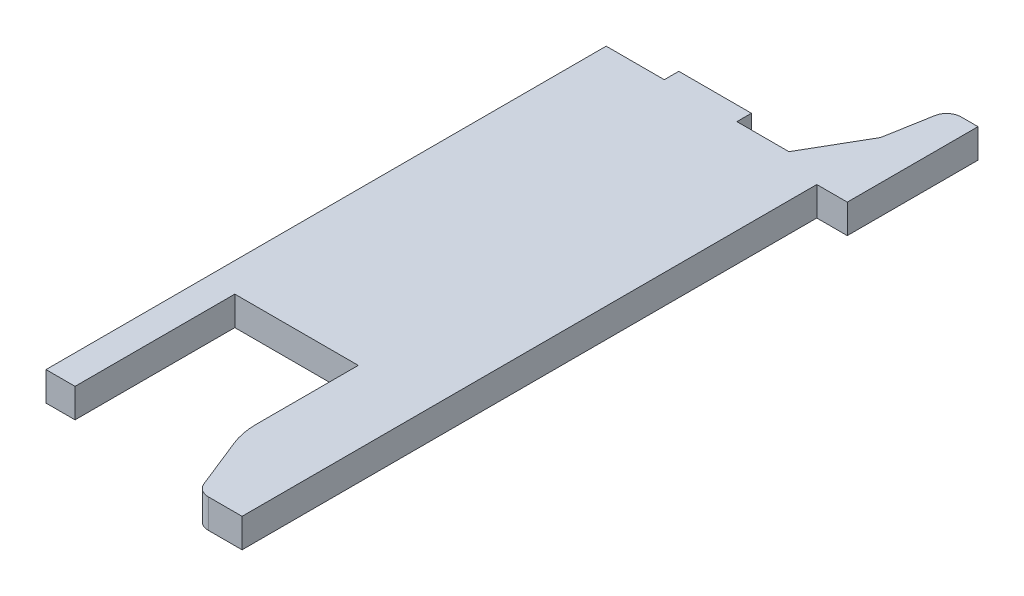
ISO-10303-21;
HEADER;
FILE_DESCRIPTION(('STEP AP214'),'2;1');
FILE_NAME('part.step','',(''),(''),'','','');
FILE_SCHEMA(('AUTOMOTIVE_DESIGN { 1 0 10303 214 1 1 1 1 }'));
ENDSEC;
DATA;
#1=APPLICATION_CONTEXT('core data for automotive mechanical design processes');
#2=APPLICATION_PROTOCOL_DEFINITION('international standard','automotive_design',2000,#1);
#3=PRODUCT_CONTEXT('',#1,'mechanical');
#4=PRODUCT('Part','Part','',(#3));
#5=PRODUCT_RELATED_PRODUCT_CATEGORY('part','',(#4));
#6=PRODUCT_DEFINITION_FORMATION('','',#4);
#7=PRODUCT_DEFINITION_CONTEXT('part definition',#1,'design');
#8=PRODUCT_DEFINITION('design','',#6,#7);
#9=PRODUCT_DEFINITION_SHAPE('','',#8);
#10=(LENGTH_UNIT() NAMED_UNIT(*) SI_UNIT(.MILLI.,.METRE.));
#11=(NAMED_UNIT(*) PLANE_ANGLE_UNIT() SI_UNIT($,.RADIAN.));
#12=(NAMED_UNIT(*) SI_UNIT($,.STERADIAN.) SOLID_ANGLE_UNIT());
#13=UNCERTAINTY_MEASURE_WITH_UNIT(LENGTH_MEASURE(1.E-05),#10,'distance_accuracy_value','');
#14=(GEOMETRIC_REPRESENTATION_CONTEXT(3) GLOBAL_UNCERTAINTY_ASSIGNED_CONTEXT((#13)) GLOBAL_UNIT_ASSIGNED_CONTEXT((#10,
#11,#12)) REPRESENTATION_CONTEXT('',''));
#15=CARTESIAN_POINT('',(0.,0.,0.));
#16=DIRECTION('',(0.,0.,1.));
#17=DIRECTION('',(1.,0.,0.));
#18=AXIS2_PLACEMENT_3D('',#15,#16,#17);
#19=CARTESIAN_POINT('',(0.868909963118,-0.1,-1.1));
#20=DIRECTION('',(0.,1.,0.));
#21=DIRECTION('',(0.,0.,1.));
#22=AXIS2_PLACEMENT_3D('',#19,#20,#21);
#23=CYLINDRICAL_SURFACE('',#22,0.1);
#24=CARTESIAN_POINT('',(0.868909963118,-0.1,-1.1));
#25=DIRECTION('',(0.,-1.,0.));
#26=DIRECTION('',(0.,0.,-1.));
#27=AXIS2_PLACEMENT_3D('',#24,#25,#26);
#28=CIRCLE('',#27,0.1);
#29=CARTESIAN_POINT('',(0.770429187817,-0.1,-1.117364817767));
#30=VERTEX_POINT('',#29);
#31=CARTESIAN_POINT('',(0.868909963118,-0.1,-1.2));
#32=VERTEX_POINT('',#31);
#33=EDGE_CURVE('E20',#30,#32,#28,.T.);
#34=ORIENTED_EDGE('',*,*,#33,.F.);
#35=DIRECTION('',(0.,-1.,0.));
#36=VECTOR('',#35,1.);
#37=CARTESIAN_POINT('',(0.770429187817,-0.1,-1.117364817767));
#38=LINE('',#37,#36);
#39=CARTESIAN_POINT('',(0.770429187817,0.1,-1.117364817767));
#40=VERTEX_POINT('',#39);
#41=EDGE_CURVE('E293',#40,#30,#38,.T.);
#42=ORIENTED_EDGE('',*,*,#41,.F.);
#43=CARTESIAN_POINT('',(0.868909963118,0.1,-1.1));
#44=DIRECTION('',(0.,1.,0.));
#45=DIRECTION('',(0.,0.,-1.));
#46=AXIS2_PLACEMENT_3D('',#43,#44,#45);
#47=CIRCLE('',#46,0.1);
#48=CARTESIAN_POINT('',(0.868909963118,0.1,-1.2));
#49=VERTEX_POINT('',#48);
#50=EDGE_CURVE('E11',#49,#40,#47,.T.);
#51=ORIENTED_EDGE('',*,*,#50,.F.);
#52=DIRECTION('',(0.,1.,0.));
#53=VECTOR('',#52,1.);
#54=CARTESIAN_POINT('',(0.868909963118,-0.1,-1.2));
#55=LINE('',#54,#53);
#56=EDGE_CURVE('E288',#32,#49,#55,.T.);
#57=ORIENTED_EDGE('',*,*,#56,.F.);
#58=EDGE_LOOP('',(#34,#42,#51,#57));
#59=FACE_BOUND('',#58,.T.);
#60=ADVANCED_FACE('F17',(#59),#23,.T.);
#61=CARTESIAN_POINT('',(0.775,0.1,3.060583310795));
#62=DIRECTION('',(0.,-1.,0.));
#63=DIRECTION('',(0.,0.,-1.));
#64=AXIS2_PLACEMENT_3D('',#61,#62,#63);
#65=PLANE('',#64);
#66=DIRECTION('',(-1.,0.,0.));
#67=VECTOR('',#66,1.);
#68=CARTESIAN_POINT('',(0.985,0.1,-1.2));
#69=LINE('',#68,#67);
#70=CARTESIAN_POINT('',(0.985,0.1,-1.2));
#71=VERTEX_POINT('',#70);
#72=EDGE_CURVE('E349',#71,#49,#69,.T.);
#73=ORIENTED_EDGE('',*,*,#72,.T.);
#74=ORIENTED_EDGE('',*,*,#50,.T.);
#75=DIRECTION('',(-0.173648177667033,0.,0.98480775301219));
#76=VECTOR('',#75,1.);
#77=CARTESIAN_POINT('',(0.785,0.1,-1.2));
#78=LINE('',#77,#76);
#79=CARTESIAN_POINT('',(0.714469207717,0.1,-0.8));
#80=VERTEX_POINT('',#79);
#81=EDGE_CURVE('E290',#40,#80,#78,.T.);
#82=ORIENTED_EDGE('',*,*,#81,.T.);
#83=DIRECTION('',(-0.50000000000019,0.,0.866025403784329));
#84=VECTOR('',#83,1.);
#85=CARTESIAN_POINT('',(0.714469207717,0.1,-0.8));
#86=LINE('',#85,#84);
#87=CARTESIAN_POINT('',(0.483529100041,0.1,-0.4));
#88=VERTEX_POINT('',#87);
#89=EDGE_CURVE('E332',#80,#88,#86,.T.);
#90=ORIENTED_EDGE('',*,*,#89,.T.);
#91=DIRECTION('',(-1.,0.,0.));
#92=VECTOR('',#91,1.);
#93=CARTESIAN_POINT('',(0.125,0.1,-0.4));
#94=LINE('',#93,#92);
#95=CARTESIAN_POINT('',(0.125,0.1,-0.4));
#96=VERTEX_POINT('',#95);
#97=EDGE_CURVE('E311',#88,#96,#94,.T.);
#98=ORIENTED_EDGE('',*,*,#97,.T.);
#99=DIRECTION('',(0.,0.,-1.));
#100=VECTOR('',#99,1.);
#101=CARTESIAN_POINT('',(0.125,0.1,-0.4));
#102=LINE('',#101,#100);
#103=CARTESIAN_POINT('',(0.125,0.1,-0.5));
#104=VERTEX_POINT('',#103);
#105=EDGE_CURVE('E283',#96,#104,#102,.T.);
#106=ORIENTED_EDGE('',*,*,#105,.T.);
#107=DIRECTION('',(-1.,0.,0.));
#108=VECTOR('',#107,1.);
#109=CARTESIAN_POINT('',(-0.375,0.1,-0.5));
#110=LINE('',#109,#108);
#111=CARTESIAN_POINT('',(-0.375,0.1,-0.5));
#112=VERTEX_POINT('',#111);
#113=EDGE_CURVE('E277',#104,#112,#110,.T.);
#114=ORIENTED_EDGE('',*,*,#113,.T.);
#115=DIRECTION('',(0.,0.,1.));
#116=VECTOR('',#115,1.);
#117=CARTESIAN_POINT('',(-0.375,0.1,-0.4));
#118=LINE('',#117,#116);
#119=CARTESIAN_POINT('',(-0.375,0.1,-0.4));
#120=VERTEX_POINT('',#119);
#121=EDGE_CURVE('E243',#112,#120,#118,.T.);
#122=ORIENTED_EDGE('',*,*,#121,.T.);
#123=DIRECTION('',(-1.,0.,0.));
#124=VECTOR('',#123,1.);
#125=CARTESIAN_POINT('',(-0.775,0.1,-0.4));
#126=LINE('',#125,#124);
#127=CARTESIAN_POINT('',(-0.775,0.1,-0.4));
#128=VERTEX_POINT('',#127);
#129=EDGE_CURVE('E226',#120,#128,#126,.T.);
#130=ORIENTED_EDGE('',*,*,#129,.T.);
#131=DIRECTION('',(0.,0.,1.));
#132=VECTOR('',#131,1.);
#133=CARTESIAN_POINT('',(-0.775,0.1,-0.4));
#134=LINE('',#133,#132);
#135=CARTESIAN_POINT('',(-0.775,0.1,3.456874512579));
#136=VERTEX_POINT('',#135);
#137=EDGE_CURVE('E230',#128,#136,#134,.T.);
#138=ORIENTED_EDGE('',*,*,#137,.T.);
#139=DIRECTION('',(1.,0.,0.));
#140=VECTOR('',#139,1.);
#141=CARTESIAN_POINT('',(-0.775,0.1,3.456874512579));
#142=LINE('',#141,#140);
#143=CARTESIAN_POINT('',(-0.575,0.1,3.456874512579));
#144=VERTEX_POINT('',#143);
#145=EDGE_CURVE('E48',#136,#144,#142,.T.);
#146=ORIENTED_EDGE('',*,*,#145,.T.);
#147=DIRECTION('',(0.,0.,-1.));
#148=VECTOR('',#147,1.);
#149=CARTESIAN_POINT('',(-0.575,0.1,2.356874512579));
#150=LINE('',#149,#148);
#151=CARTESIAN_POINT('',(-0.575,0.1,2.356874512579));
#152=VERTEX_POINT('',#151);
#153=EDGE_CURVE('E414',#144,#152,#150,.T.);
#154=ORIENTED_EDGE('',*,*,#153,.T.);
#155=DIRECTION('',(1.,0.,0.));
#156=VECTOR('',#155,1.);
#157=CARTESIAN_POINT('',(-0.575,0.1,2.356874512579));
#158=LINE('',#157,#156);
#159=CARTESIAN_POINT('',(0.275,0.1,2.356874512579));
#160=VERTEX_POINT('',#159);
#161=EDGE_CURVE('E407',#152,#160,#158,.T.);
#162=ORIENTED_EDGE('',*,*,#161,.T.);
#163=DIRECTION('',(0.,0.,1.));
#164=VECTOR('',#163,1.);
#165=CARTESIAN_POINT('',(0.275,0.1,2.356874512579));
#166=LINE('',#165,#164);
#167=CARTESIAN_POINT('',(0.275,0.1,3.060583310795));
#168=VERTEX_POINT('',#167);
#169=EDGE_CURVE('E397',#160,#168,#166,.T.);
#170=ORIENTED_EDGE('',*,*,#169,.T.);
#171=CARTESIAN_POINT('',(0.775,0.1,3.060583310795));
#172=DIRECTION('',(0.,1.,0.));
#173=DIRECTION('',(0.,0.,-1.));
#174=AXIS2_PLACEMENT_3D('',#171,#172,#173);
#175=CIRCLE('',#174,0.5);
#176=CARTESIAN_POINT('',(0.310761654557,0.1,3.246278648972));
#177=VERTEX_POINT('',#176);
#178=EDGE_CURVE('E252',#168,#177,#175,.T.);
#179=ORIENTED_EDGE('',*,*,#178,.T.);
#180=DIRECTION('',(0.371390676354104,0.,0.928476690885259));
#181=VECTOR('',#180,1.);
#182=CARTESIAN_POINT('',(0.449855627054,0.1,3.594013580214));
#183=LINE('',#182,#181);
#184=CARTESIAN_POINT('',(0.449855627054,0.1,3.594013580214));
#185=VERTEX_POINT('',#184);
#186=EDGE_CURVE('E325',#177,#185,#183,.T.);
#187=ORIENTED_EDGE('',*,*,#186,.T.);
#188=CARTESIAN_POINT('',(0.542703296143,0.1,3.556874512579));
#189=DIRECTION('',(0.,1.,0.));
#190=DIRECTION('',(0.,0.,1.));
#191=AXIS2_PLACEMENT_3D('',#188,#189,#190);
#192=CIRCLE('',#191,0.1);
#193=CARTESIAN_POINT('',(0.542703296143,0.1,3.656874512579));
#194=VERTEX_POINT('',#193);
#195=EDGE_CURVE('E304',#185,#194,#192,.T.);
#196=ORIENTED_EDGE('',*,*,#195,.T.);
#197=DIRECTION('',(1.,0.,0.));
#198=VECTOR('',#197,1.);
#199=CARTESIAN_POINT('',(0.775,0.1,3.656874512579));
#200=LINE('',#199,#198);
#201=CARTESIAN_POINT('',(0.775,0.1,3.656874512579));
#202=VERTEX_POINT('',#201);
#203=EDGE_CURVE('E259',#194,#202,#200,.T.);
#204=ORIENTED_EDGE('',*,*,#203,.T.);
#205=DIRECTION('',(0.,0.,-1.));
#206=VECTOR('',#205,1.);
#207=CARTESIAN_POINT('',(0.775,0.1,-0.3));
#208=LINE('',#207,#206);
#209=CARTESIAN_POINT('',(0.775,0.1,-0.3));
#210=VERTEX_POINT('',#209);
#211=EDGE_CURVE('E363',#202,#210,#208,.T.);
#212=ORIENTED_EDGE('',*,*,#211,.T.);
#213=DIRECTION('',(1.,0.,0.));
#214=VECTOR('',#213,1.);
#215=CARTESIAN_POINT('',(0.775,0.1,-0.3));
#216=LINE('',#215,#214);
#217=CARTESIAN_POINT('',(0.985,0.1,-0.3));
#218=VERTEX_POINT('',#217);
#219=EDGE_CURVE('E270',#210,#218,#216,.T.);
#220=ORIENTED_EDGE('',*,*,#219,.T.);
#221=DIRECTION('',(0.,0.,-1.));
#222=VECTOR('',#221,1.);
#223=CARTESIAN_POINT('',(0.985,0.1,-0.4));
#224=LINE('',#223,#222);
#225=EDGE_CURVE('E360',#218,#71,#224,.T.);
#226=ORIENTED_EDGE('',*,*,#225,.T.);
#227=EDGE_LOOP('',(#73,#74,#82,#90,#98,#106,#114,#122,#130,#138,#146,#154,#162,#170,#179,#187,
#196,#204,#212,#220,#226));
#228=FACE_BOUND('',#227,.T.);
#229=ADVANCED_FACE('F439',(#228),#65,.F.);
#230=CARTESIAN_POINT('',(0.775,-0.1,3.060583310795));
#231=DIRECTION('',(0.,-1.,0.));
#232=DIRECTION('',(0.,0.,-1.));
#233=AXIS2_PLACEMENT_3D('',#230,#231,#232);
#234=PLANE('',#233);
#235=DIRECTION('',(-0.173648177667033,0.,0.98480775301219));
#236=VECTOR('',#235,1.);
#237=CARTESIAN_POINT('',(0.785,-0.1,-1.2));
#238=LINE('',#237,#236);
#239=CARTESIAN_POINT('',(0.714469207717,-0.1,-0.8));
#240=VERTEX_POINT('',#239);
#241=EDGE_CURVE('E289',#30,#240,#238,.T.);
#242=ORIENTED_EDGE('',*,*,#241,.F.);
#243=ORIENTED_EDGE('',*,*,#33,.T.);
#244=DIRECTION('',(-1.,0.,0.));
#245=VECTOR('',#244,1.);
#246=CARTESIAN_POINT('',(0.985,-0.1,-1.2));
#247=LINE('',#246,#245);
#248=CARTESIAN_POINT('',(0.985,-0.1,-1.2));
#249=VERTEX_POINT('',#248);
#250=EDGE_CURVE('E284',#249,#32,#247,.T.);
#251=ORIENTED_EDGE('',*,*,#250,.F.);
#252=DIRECTION('',(0.,0.,-1.));
#253=VECTOR('',#252,1.);
#254=CARTESIAN_POINT('',(0.985,-0.1,-0.4));
#255=LINE('',#254,#253);
#256=CARTESIAN_POINT('',(0.985,-0.1,-0.3));
#257=VERTEX_POINT('',#256);
#258=EDGE_CURVE('E356',#257,#249,#255,.T.);
#259=ORIENTED_EDGE('',*,*,#258,.F.);
#260=DIRECTION('',(1.,0.,0.));
#261=VECTOR('',#260,1.);
#262=CARTESIAN_POINT('',(0.775,-0.1,-0.3));
#263=LINE('',#262,#261);
#264=CARTESIAN_POINT('',(0.775,-0.1,-0.3));
#265=VERTEX_POINT('',#264);
#266=EDGE_CURVE('E269',#265,#257,#263,.T.);
#267=ORIENTED_EDGE('',*,*,#266,.F.);
#268=DIRECTION('',(0.,0.,-1.));
#269=VECTOR('',#268,1.);
#270=CARTESIAN_POINT('',(0.775,-0.1,-0.3));
#271=LINE('',#270,#269);
#272=CARTESIAN_POINT('',(0.775,-0.1,3.656874512579));
#273=VERTEX_POINT('',#272);
#274=EDGE_CURVE('E380',#273,#265,#271,.T.);
#275=ORIENTED_EDGE('',*,*,#274,.F.);
#276=DIRECTION('',(1.,0.,0.));
#277=VECTOR('',#276,1.);
#278=CARTESIAN_POINT('',(0.775,-0.1,3.656874512579));
#279=LINE('',#278,#277);
#280=CARTESIAN_POINT('',(0.542703296143,-0.1,3.656874512579));
#281=VERTEX_POINT('',#280);
#282=EDGE_CURVE('E258',#281,#273,#279,.T.);
#283=ORIENTED_EDGE('',*,*,#282,.F.);
#284=CARTESIAN_POINT('',(0.542703296143,-0.1,3.556874512579));
#285=DIRECTION('',(0.,1.,0.));
#286=DIRECTION('',(0.,0.,1.));
#287=AXIS2_PLACEMENT_3D('',#284,#285,#286);
#288=CIRCLE('',#287,0.1);
#289=CARTESIAN_POINT('',(0.449855627054,-0.1,3.594013580214));
#290=VERTEX_POINT('',#289);
#291=EDGE_CURVE('E316',#290,#281,#288,.T.);
#292=ORIENTED_EDGE('',*,*,#291,.F.);
#293=DIRECTION('',(0.371390676354104,0.,0.928476690885259));
#294=VECTOR('',#293,1.);
#295=CARTESIAN_POINT('',(0.449855627054,-0.1,3.594013580214));
#296=LINE('',#295,#294);
#297=CARTESIAN_POINT('',(0.310761654557,-0.1,3.246278648972));
#298=VERTEX_POINT('',#297);
#299=EDGE_CURVE('E324',#298,#290,#296,.T.);
#300=ORIENTED_EDGE('',*,*,#299,.F.);
#301=CARTESIAN_POINT('',(0.775,-0.1,3.060583310795));
#302=DIRECTION('',(0.,1.,0.));
#303=DIRECTION('',(0.,0.,-1.));
#304=AXIS2_PLACEMENT_3D('',#301,#302,#303);
#305=CIRCLE('',#304,0.5);
#306=CARTESIAN_POINT('',(0.275,-0.1,3.060583310795));
#307=VERTEX_POINT('',#306);
#308=EDGE_CURVE('E251',#307,#298,#305,.T.);
#309=ORIENTED_EDGE('',*,*,#308,.F.);
#310=DIRECTION('',(0.,0.,1.));
#311=VECTOR('',#310,1.);
#312=CARTESIAN_POINT('',(0.275,-0.1,2.356874512579));
#313=LINE('',#312,#311);
#314=CARTESIAN_POINT('',(0.275,-0.1,2.356874512579));
#315=VERTEX_POINT('',#314);
#316=EDGE_CURVE('E404',#315,#307,#313,.T.);
#317=ORIENTED_EDGE('',*,*,#316,.F.);
#318=DIRECTION('',(1.,0.,0.));
#319=VECTOR('',#318,1.);
#320=CARTESIAN_POINT('',(-0.575,-0.1,2.356874512579));
#321=LINE('',#320,#319);
#322=CARTESIAN_POINT('',(-0.575,-0.1,2.356874512579));
#323=VERTEX_POINT('',#322);
#324=EDGE_CURVE('E238',#323,#315,#321,.T.);
#325=ORIENTED_EDGE('',*,*,#324,.F.);
#326=DIRECTION('',(0.,0.,-1.));
#327=VECTOR('',#326,1.);
#328=CARTESIAN_POINT('',(-0.575,-0.1,2.356874512579));
#329=LINE('',#328,#327);
#330=CARTESIAN_POINT('',(-0.575,-0.1,3.456874512579));
#331=VERTEX_POINT('',#330);
#332=EDGE_CURVE('E214',#331,#323,#329,.T.);
#333=ORIENTED_EDGE('',*,*,#332,.F.);
#334=DIRECTION('',(1.,0.,0.));
#335=VECTOR('',#334,1.);
#336=CARTESIAN_POINT('',(-0.775,-0.1,3.456874512579));
#337=LINE('',#336,#335);
#338=CARTESIAN_POINT('',(-0.775,-0.1,3.456874512579));
#339=VERTEX_POINT('',#338);
#340=EDGE_CURVE('E38',#339,#331,#337,.T.);
#341=ORIENTED_EDGE('',*,*,#340,.F.);
#342=DIRECTION('',(0.,0.,1.));
#343=VECTOR('',#342,1.);
#344=CARTESIAN_POINT('',(-0.775,-0.1,-0.4));
#345=LINE('',#344,#343);
#346=CARTESIAN_POINT('',(-0.775,-0.1,-0.4));
#347=VERTEX_POINT('',#346);
#348=EDGE_CURVE('E211',#347,#339,#345,.T.);
#349=ORIENTED_EDGE('',*,*,#348,.F.);
#350=DIRECTION('',(-1.,0.,0.));
#351=VECTOR('',#350,1.);
#352=CARTESIAN_POINT('',(-0.775,-0.1,-0.4));
#353=LINE('',#352,#351);
#354=CARTESIAN_POINT('',(-0.375,-0.1,-0.4));
#355=VERTEX_POINT('',#354);
#356=EDGE_CURVE('E247',#355,#347,#353,.T.);
#357=ORIENTED_EDGE('',*,*,#356,.F.);
#358=DIRECTION('',(0.,0.,1.));
#359=VECTOR('',#358,1.);
#360=CARTESIAN_POINT('',(-0.375,-0.1,-0.4));
#361=LINE('',#360,#359);
#362=CARTESIAN_POINT('',(-0.375,-0.1,-0.5));
#363=VERTEX_POINT('',#362);
#364=EDGE_CURVE('E274',#363,#355,#361,.T.);
#365=ORIENTED_EDGE('',*,*,#364,.F.);
#366=DIRECTION('',(-1.,0.,0.));
#367=VECTOR('',#366,1.);
#368=CARTESIAN_POINT('',(-0.375,-0.1,-0.5));
#369=LINE('',#368,#367);
#370=CARTESIAN_POINT('',(0.125,-0.1,-0.5));
#371=VERTEX_POINT('',#370);
#372=EDGE_CURVE('E301',#371,#363,#369,.T.);
#373=ORIENTED_EDGE('',*,*,#372,.F.);
#374=DIRECTION('',(0.,0.,-1.));
#375=VECTOR('',#374,1.);
#376=CARTESIAN_POINT('',(0.125,-0.1,-0.4));
#377=LINE('',#376,#375);
#378=CARTESIAN_POINT('',(0.125,-0.1,-0.4));
#379=VERTEX_POINT('',#378);
#380=EDGE_CURVE('E282',#379,#371,#377,.T.);
#381=ORIENTED_EDGE('',*,*,#380,.F.);
#382=DIRECTION('',(-1.,0.,0.));
#383=VECTOR('',#382,1.);
#384=CARTESIAN_POINT('',(0.125,-0.1,-0.4));
#385=LINE('',#384,#383);
#386=CARTESIAN_POINT('',(0.483529100041,-0.1,-0.4));
#387=VERTEX_POINT('',#386);
#388=EDGE_CURVE('E329',#387,#379,#385,.T.);
#389=ORIENTED_EDGE('',*,*,#388,.F.);
#390=DIRECTION('',(-0.50000000000019,0.,0.866025403784329));
#391=VECTOR('',#390,1.);
#392=CARTESIAN_POINT('',(0.714469207717,-0.1,-0.8));
#393=LINE('',#392,#391);
#394=EDGE_CURVE('E294',#240,#387,#393,.T.);
#395=ORIENTED_EDGE('',*,*,#394,.F.);
#396=EDGE_LOOP('',(#242,#243,#251,#259,#267,#275,#283,#292,#300,#309,#317,#325,#333,#341,#349,
#357,#365,#373,#381,#389,#395));
#397=FACE_BOUND('',#396,.T.);
#398=ADVANCED_FACE('F209',(#397),#234,.T.);
#399=CARTESIAN_POINT('',(-0.775,-0.1,3.456874512579));
#400=DIRECTION('',(0.,0.,1.));
#401=DIRECTION('',(1.,0.,0.));
#402=AXIS2_PLACEMENT_3D('',#399,#400,#401);
#403=PLANE('',#402);
#404=DIRECTION('',(0.,1.,0.));
#405=VECTOR('',#404,1.);
#406=CARTESIAN_POINT('',(-0.575,-0.1,3.456874512579));
#407=LINE('',#406,#405);
#408=EDGE_CURVE('E416',#331,#144,#407,.T.);
#409=ORIENTED_EDGE('',*,*,#408,.T.);
#410=ORIENTED_EDGE('',*,*,#145,.F.);
#411=DIRECTION('',(0.,1.,0.));
#412=VECTOR('',#411,1.);
#413=CARTESIAN_POINT('',(-0.775,-0.1,3.456874512579));
#414=LINE('',#413,#412);
#415=EDGE_CURVE('E222',#339,#136,#414,.T.);
#416=ORIENTED_EDGE('',*,*,#415,.F.);
#417=ORIENTED_EDGE('',*,*,#340,.T.);
#418=EDGE_LOOP('',(#409,#410,#416,#417));
#419=FACE_BOUND('',#418,.T.);
#420=ADVANCED_FACE('F228',(#419),#403,.T.);
#421=CARTESIAN_POINT('',(-0.575,-0.1,2.356874512579));
#422=DIRECTION('',(1.,0.,0.));
#423=DIRECTION('',(0.,0.,-1.));
#424=AXIS2_PLACEMENT_3D('',#421,#422,#423);
#425=PLANE('',#424);
#426=DIRECTION('',(0.,1.,0.));
#427=VECTOR('',#426,1.);
#428=CARTESIAN_POINT('',(-0.575,-0.1,2.356874512579));
#429=LINE('',#428,#427);
#430=EDGE_CURVE('E410',#323,#152,#429,.T.);
#431=ORIENTED_EDGE('',*,*,#430,.T.);
#432=ORIENTED_EDGE('',*,*,#153,.F.);
#433=ORIENTED_EDGE('',*,*,#408,.F.);
#434=ORIENTED_EDGE('',*,*,#332,.T.);
#435=EDGE_LOOP('',(#431,#432,#433,#434));
#436=FACE_BOUND('',#435,.T.);
#437=ADVANCED_FACE('F667',(#436),#425,.T.);
#438=CARTESIAN_POINT('',(-0.575,-0.1,2.356874512579));
#439=DIRECTION('',(0.,0.,1.));
#440=DIRECTION('',(1.,0.,0.));
#441=AXIS2_PLACEMENT_3D('',#438,#439,#440);
#442=PLANE('',#441);
#443=DIRECTION('',(0.,1.,0.));
#444=VECTOR('',#443,1.);
#445=CARTESIAN_POINT('',(0.275,-0.1,2.356874512579));
#446=LINE('',#445,#444);
#447=EDGE_CURVE('E400',#315,#160,#446,.T.);
#448=ORIENTED_EDGE('',*,*,#447,.T.);
#449=ORIENTED_EDGE('',*,*,#161,.F.);
#450=ORIENTED_EDGE('',*,*,#430,.F.);
#451=ORIENTED_EDGE('',*,*,#324,.T.);
#452=EDGE_LOOP('',(#448,#449,#450,#451));
#453=FACE_BOUND('',#452,.T.);
#454=ADVANCED_FACE('F657',(#453),#442,.T.);
#455=CARTESIAN_POINT('',(0.275,-0.1,2.356874512579));
#456=DIRECTION('',(-1.,0.,0.));
#457=DIRECTION('',(0.,1.,0.));
#458=AXIS2_PLACEMENT_3D('',#455,#456,#457);
#459=PLANE('',#458);
#460=DIRECTION('',(0.,1.,0.));
#461=VECTOR('',#460,1.);
#462=CARTESIAN_POINT('',(0.275,-0.1,3.060583310795));
#463=LINE('',#462,#461);
#464=EDGE_CURVE('E248',#307,#168,#463,.T.);
#465=ORIENTED_EDGE('',*,*,#464,.T.);
#466=ORIENTED_EDGE('',*,*,#169,.F.);
#467=ORIENTED_EDGE('',*,*,#447,.F.);
#468=ORIENTED_EDGE('',*,*,#316,.T.);
#469=EDGE_LOOP('',(#465,#466,#467,#468));
#470=FACE_BOUND('',#469,.T.);
#471=ADVANCED_FACE('F665',(#470),#459,.T.);
#472=CARTESIAN_POINT('',(0.775,-0.1,3.060583310795));
#473=DIRECTION('',(0.,1.,0.));
#474=DIRECTION('',(0.,0.,1.));
#475=AXIS2_PLACEMENT_3D('',#472,#473,#474);
#476=CYLINDRICAL_SURFACE('',#475,0.5);
#477=DIRECTION('',(0.,1.,0.));
#478=VECTOR('',#477,1.);
#479=CARTESIAN_POINT('',(0.310761654557,-0.1,3.246278648972));
#480=LINE('',#479,#478);
#481=EDGE_CURVE('E320',#298,#177,#480,.T.);
#482=ORIENTED_EDGE('',*,*,#481,.T.);
#483=ORIENTED_EDGE('',*,*,#178,.F.);
#484=ORIENTED_EDGE('',*,*,#464,.F.);
#485=ORIENTED_EDGE('',*,*,#308,.T.);
#486=EDGE_LOOP('',(#482,#483,#484,#485));
#487=FACE_BOUND('',#486,.T.);
#488=ADVANCED_FACE('F723',(#487),#476,.T.);
#489=CARTESIAN_POINT('',(0.449855627054,-0.1,3.594013580214));
#490=DIRECTION('',(-0.928476690885259,0.,0.371390676354104));
#491=DIRECTION('',(0.,1.,0.));
#492=AXIS2_PLACEMENT_3D('',#489,#490,#491);
#493=PLANE('',#492);
#494=DIRECTION('',(0.,1.,0.));
#495=VECTOR('',#494,1.);
#496=CARTESIAN_POINT('',(0.449855627054,-0.1,3.594013580214));
#497=LINE('',#496,#495);
#498=EDGE_CURVE('E307',#290,#185,#497,.T.);
#499=ORIENTED_EDGE('',*,*,#498,.T.);
#500=ORIENTED_EDGE('',*,*,#186,.F.);
#501=ORIENTED_EDGE('',*,*,#481,.F.);
#502=ORIENTED_EDGE('',*,*,#299,.T.);
#503=EDGE_LOOP('',(#499,#500,#501,#502));
#504=FACE_BOUND('',#503,.T.);
#505=ADVANCED_FACE('F733',(#504),#493,.T.);
#506=CARTESIAN_POINT('',(0.542703296143,-0.1,3.556874512579));
#507=DIRECTION('',(0.,1.,0.));
#508=DIRECTION('',(0.,0.,1.));
#509=AXIS2_PLACEMENT_3D('',#506,#507,#508);
#510=CYLINDRICAL_SURFACE('',#509,0.1);
#511=DIRECTION('',(0.,1.,0.));
#512=VECTOR('',#511,1.);
#513=CARTESIAN_POINT('',(0.542703296143,-0.1,3.656874512579));
#514=LINE('',#513,#512);
#515=EDGE_CURVE('E254',#281,#194,#514,.T.);
#516=ORIENTED_EDGE('',*,*,#515,.T.);
#517=ORIENTED_EDGE('',*,*,#195,.F.);
#518=ORIENTED_EDGE('',*,*,#498,.F.);
#519=ORIENTED_EDGE('',*,*,#291,.T.);
#520=EDGE_LOOP('',(#516,#517,#518,#519));
#521=FACE_BOUND('',#520,.T.);
#522=ADVANCED_FACE('F744',(#521),#510,.T.);
#523=CARTESIAN_POINT('',(0.775,-0.1,3.656874512579));
#524=DIRECTION('',(0.,0.,1.));
#525=DIRECTION('',(1.,0.,0.));
#526=AXIS2_PLACEMENT_3D('',#523,#524,#525);
#527=PLANE('',#526);
#528=DIRECTION('',(0.,1.,0.));
#529=VECTOR('',#528,1.);
#530=CARTESIAN_POINT('',(0.775,-0.1,3.656874512579));
#531=LINE('',#530,#529);
#532=EDGE_CURVE('E376',#273,#202,#531,.T.);
#533=ORIENTED_EDGE('',*,*,#532,.T.);
#534=ORIENTED_EDGE('',*,*,#203,.F.);
#535=ORIENTED_EDGE('',*,*,#515,.F.);
#536=ORIENTED_EDGE('',*,*,#282,.T.);
#537=EDGE_LOOP('',(#533,#534,#535,#536));
#538=FACE_BOUND('',#537,.T.);
#539=ADVANCED_FACE('F755',(#538),#527,.T.);
#540=CARTESIAN_POINT('',(0.775,-0.1,-0.3));
#541=DIRECTION('',(1.,0.,0.));
#542=DIRECTION('',(0.,0.,-1.));
#543=AXIS2_PLACEMENT_3D('',#540,#541,#542);
#544=PLANE('',#543);
#545=DIRECTION('',(0.,1.,0.));
#546=VECTOR('',#545,1.);
#547=CARTESIAN_POINT('',(0.775,-0.1,-0.3));
#548=LINE('',#547,#546);
#549=EDGE_CURVE('E265',#265,#210,#548,.T.);
#550=ORIENTED_EDGE('',*,*,#549,.T.);
#551=ORIENTED_EDGE('',*,*,#211,.F.);
#552=ORIENTED_EDGE('',*,*,#532,.F.);
#553=ORIENTED_EDGE('',*,*,#274,.T.);
#554=EDGE_LOOP('',(#550,#551,#552,#553));
#555=FACE_BOUND('',#554,.T.);
#556=ADVANCED_FACE('F767',(#555),#544,.T.);
#557=CARTESIAN_POINT('',(0.775,-0.1,-0.3));
#558=DIRECTION('',(0.,0.,1.));
#559=DIRECTION('',(1.,0.,0.));
#560=AXIS2_PLACEMENT_3D('',#557,#558,#559);
#561=PLANE('',#560);
#562=DIRECTION('',(0.,1.,0.));
#563=VECTOR('',#562,1.);
#564=CARTESIAN_POINT('',(0.985,-0.1,-0.3));
#565=LINE('',#564,#563);
#566=EDGE_CURVE('E366',#257,#218,#565,.T.);
#567=ORIENTED_EDGE('',*,*,#566,.T.);
#568=ORIENTED_EDGE('',*,*,#219,.F.);
#569=ORIENTED_EDGE('',*,*,#549,.F.);
#570=ORIENTED_EDGE('',*,*,#266,.T.);
#571=EDGE_LOOP('',(#567,#568,#569,#570));
#572=FACE_BOUND('',#571,.T.);
#573=ADVANCED_FACE('F779',(#572),#561,.T.);
#574=CARTESIAN_POINT('',(0.985,-0.1,-0.4));
#575=DIRECTION('',(1.,0.,0.));
#576=DIRECTION('',(0.,1.,0.));
#577=AXIS2_PLACEMENT_3D('',#574,#575,#576);
#578=PLANE('',#577);
#579=DIRECTION('',(0.,1.,0.));
#580=VECTOR('',#579,1.);
#581=CARTESIAN_POINT('',(0.985,-0.1,-1.2));
#582=LINE('',#581,#580);
#583=EDGE_CURVE('E353',#249,#71,#582,.T.);
#584=ORIENTED_EDGE('',*,*,#583,.T.);
#585=ORIENTED_EDGE('',*,*,#225,.F.);
#586=ORIENTED_EDGE('',*,*,#566,.F.);
#587=ORIENTED_EDGE('',*,*,#258,.T.);
#588=EDGE_LOOP('',(#584,#585,#586,#587));
#589=FACE_BOUND('',#588,.T.);
#590=ADVANCED_FACE('F790',(#589),#578,.T.);
#591=CARTESIAN_POINT('',(0.985,-0.1,-1.2));
#592=DIRECTION('',(0.,0.,-1.));
#593=DIRECTION('',(0.,-1.,0.));
#594=AXIS2_PLACEMENT_3D('',#591,#592,#593);
#595=PLANE('',#594);
#596=ORIENTED_EDGE('',*,*,#250,.T.);
#597=ORIENTED_EDGE('',*,*,#56,.T.);
#598=ORIENTED_EDGE('',*,*,#72,.F.);
#599=ORIENTED_EDGE('',*,*,#583,.F.);
#600=EDGE_LOOP('',(#596,#597,#598,#599));
#601=FACE_BOUND('',#600,.T.);
#602=ADVANCED_FACE('F800',(#601),#595,.T.);
#603=CARTESIAN_POINT('',(0.785,-0.1,-1.2));
#604=DIRECTION('',(-0.98480775301219,0.,-0.173648177667033));
#605=DIRECTION('',(-0.173648177667033,0.,0.98480775301219));
#606=AXIS2_PLACEMENT_3D('',#603,#604,#605);
#607=PLANE('',#606);
#608=ORIENTED_EDGE('',*,*,#81,.F.);
#609=ORIENTED_EDGE('',*,*,#41,.T.);
#610=ORIENTED_EDGE('',*,*,#241,.T.);
#611=DIRECTION('',(0.,1.,0.));
#612=VECTOR('',#611,1.);
#613=CARTESIAN_POINT('',(0.714469207717,-0.1,-0.8));
#614=LINE('',#613,#612);
#615=EDGE_CURVE('E335',#240,#80,#614,.T.);
#616=ORIENTED_EDGE('',*,*,#615,.T.);
#617=EDGE_LOOP('',(#608,#609,#610,#616));
#618=FACE_BOUND('',#617,.T.);
#619=ADVANCED_FACE('F465',(#618),#607,.T.);
#620=CARTESIAN_POINT('',(0.714469207717,-0.1,-0.8));
#621=DIRECTION('',(-0.866025403784329,0.,-0.50000000000019));
#622=DIRECTION('',(-0.50000000000019,0.,0.866025403784329));
#623=AXIS2_PLACEMENT_3D('',#620,#621,#622);
#624=PLANE('',#623);
#625=DIRECTION('',(0.,1.,0.));
#626=VECTOR('',#625,1.);
#627=CARTESIAN_POINT('',(0.483529100041,-0.1,-0.4));
#628=LINE('',#627,#626);
#629=EDGE_CURVE('E319',#387,#88,#628,.T.);
#630=ORIENTED_EDGE('',*,*,#629,.T.);
#631=ORIENTED_EDGE('',*,*,#89,.F.);
#632=ORIENTED_EDGE('',*,*,#615,.F.);
#633=ORIENTED_EDGE('',*,*,#394,.T.);
#634=EDGE_LOOP('',(#630,#631,#632,#633));
#635=FACE_BOUND('',#634,.T.);
#636=ADVANCED_FACE('F458',(#635),#624,.T.);
#637=CARTESIAN_POINT('',(0.125,-0.1,-0.4));
#638=DIRECTION('',(0.,0.,-1.));
#639=DIRECTION('',(-1.,0.,0.));
#640=AXIS2_PLACEMENT_3D('',#637,#638,#639);
#641=PLANE('',#640);
#642=DIRECTION('',(0.,1.,0.));
#643=VECTOR('',#642,1.);
#644=CARTESIAN_POINT('',(0.125,-0.1,-0.4));
#645=LINE('',#644,#643);
#646=EDGE_CURVE('E278',#379,#96,#645,.T.);
#647=ORIENTED_EDGE('',*,*,#646,.T.);
#648=ORIENTED_EDGE('',*,*,#97,.F.);
#649=ORIENTED_EDGE('',*,*,#629,.F.);
#650=ORIENTED_EDGE('',*,*,#388,.T.);
#651=EDGE_LOOP('',(#647,#648,#649,#650));
#652=FACE_BOUND('',#651,.T.);
#653=ADVANCED_FACE('F455',(#652),#641,.T.);
#654=CARTESIAN_POINT('',(0.125,-0.1,-0.4));
#655=DIRECTION('',(1.,0.,0.));
#656=DIRECTION('',(0.,1.,0.));
#657=AXIS2_PLACEMENT_3D('',#654,#655,#656);
#658=PLANE('',#657);
#659=DIRECTION('',(0.,1.,0.));
#660=VECTOR('',#659,1.);
#661=CARTESIAN_POINT('',(0.125,-0.1,-0.5));
#662=LINE('',#661,#660);
#663=EDGE_CURVE('E297',#371,#104,#662,.T.);
#664=ORIENTED_EDGE('',*,*,#663,.T.);
#665=ORIENTED_EDGE('',*,*,#105,.F.);
#666=ORIENTED_EDGE('',*,*,#646,.F.);
#667=ORIENTED_EDGE('',*,*,#380,.T.);
#668=EDGE_LOOP('',(#664,#665,#666,#667));
#669=FACE_BOUND('',#668,.T.);
#670=ADVANCED_FACE('F452',(#669),#658,.T.);
#671=CARTESIAN_POINT('',(-0.375,-0.1,-0.5));
#672=DIRECTION('',(0.,0.,-1.));
#673=DIRECTION('',(0.,-1.,0.));
#674=AXIS2_PLACEMENT_3D('',#671,#672,#673);
#675=PLANE('',#674);
#676=DIRECTION('',(0.,1.,0.));
#677=VECTOR('',#676,1.);
#678=CARTESIAN_POINT('',(-0.375,-0.1,-0.5));
#679=LINE('',#678,#677);
#680=EDGE_CURVE('E246',#363,#112,#679,.T.);
#681=ORIENTED_EDGE('',*,*,#680,.T.);
#682=ORIENTED_EDGE('',*,*,#113,.F.);
#683=ORIENTED_EDGE('',*,*,#663,.F.);
#684=ORIENTED_EDGE('',*,*,#372,.T.);
#685=EDGE_LOOP('',(#681,#682,#683,#684));
#686=FACE_BOUND('',#685,.T.);
#687=ADVANCED_FACE('F444',(#686),#675,.T.);
#688=CARTESIAN_POINT('',(-0.375,-0.1,-0.4));
#689=DIRECTION('',(-1.,0.,0.));
#690=DIRECTION('',(0.,0.,1.));
#691=AXIS2_PLACEMENT_3D('',#688,#689,#690);
#692=PLANE('',#691);
#693=DIRECTION('',(0.,1.,0.));
#694=VECTOR('',#693,1.);
#695=CARTESIAN_POINT('',(-0.375,-0.1,-0.4));
#696=LINE('',#695,#694);
#697=EDGE_CURVE('E262',#355,#120,#696,.T.);
#698=ORIENTED_EDGE('',*,*,#697,.T.);
#699=ORIENTED_EDGE('',*,*,#121,.F.);
#700=ORIENTED_EDGE('',*,*,#680,.F.);
#701=ORIENTED_EDGE('',*,*,#364,.T.);
#702=EDGE_LOOP('',(#698,#699,#700,#701));
#703=FACE_BOUND('',#702,.T.);
#704=ADVANCED_FACE('F434',(#703),#692,.T.);
#705=CARTESIAN_POINT('',(-0.775,-0.1,-0.4));
#706=DIRECTION('',(0.,0.,-1.));
#707=DIRECTION('',(0.,-1.,0.));
#708=AXIS2_PLACEMENT_3D('',#705,#706,#707);
#709=PLANE('',#708);
#710=DIRECTION('',(0.,1.,0.));
#711=VECTOR('',#710,1.);
#712=CARTESIAN_POINT('',(-0.775,-0.1,-0.4));
#713=LINE('',#712,#711);
#714=EDGE_CURVE('E224',#347,#128,#713,.T.);
#715=ORIENTED_EDGE('',*,*,#714,.T.);
#716=ORIENTED_EDGE('',*,*,#129,.F.);
#717=ORIENTED_EDGE('',*,*,#697,.F.);
#718=ORIENTED_EDGE('',*,*,#356,.T.);
#719=EDGE_LOOP('',(#715,#716,#717,#718));
#720=FACE_BOUND('',#719,.T.);
#721=ADVANCED_FACE('F438',(#720),#709,.T.);
#722=CARTESIAN_POINT('',(-0.775,-0.1,-0.4));
#723=DIRECTION('',(-1.,0.,0.));
#724=DIRECTION('',(0.,1.,0.));
#725=AXIS2_PLACEMENT_3D('',#722,#723,#724);
#726=PLANE('',#725);
#727=ORIENTED_EDGE('',*,*,#415,.T.);
#728=ORIENTED_EDGE('',*,*,#137,.F.);
#729=ORIENTED_EDGE('',*,*,#714,.F.);
#730=ORIENTED_EDGE('',*,*,#348,.T.);
#731=EDGE_LOOP('',(#727,#728,#729,#730));
#732=FACE_BOUND('',#731,.T.);
#733=ADVANCED_FACE('F220',(#732),#726,.T.);
#734=CLOSED_SHELL('',(#60,#229,#398,#420,#437,#454,#471,#488,#505,#522,#539,#556,#573,#590,#602,
#619,#636,#653,#670,#687,#704,#721,#733));
#735=MANIFOLD_SOLID_BREP('B1',#734);
#736=ADVANCED_BREP_SHAPE_REPRESENTATION('',(#18,#735),#14);
#737=SHAPE_DEFINITION_REPRESENTATION(#9,#736);
ENDSEC;
END-ISO-10303-21;
